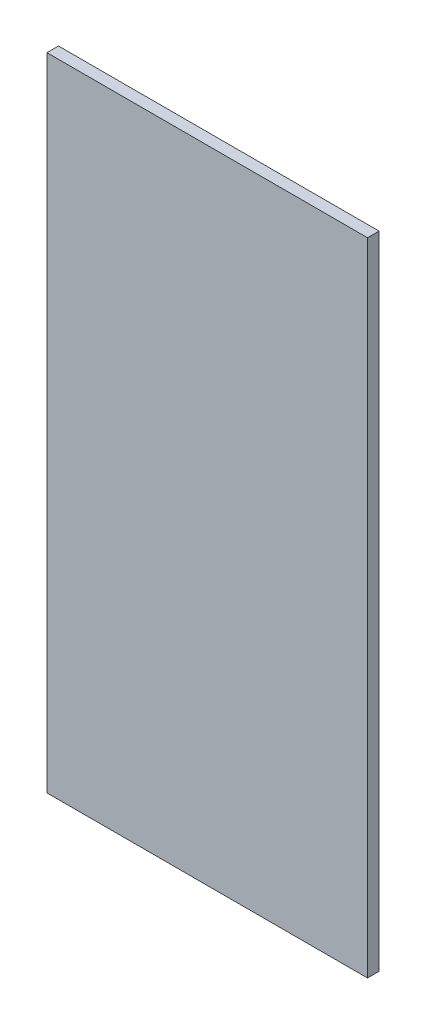
ISO-10303-21;
HEADER;
FILE_DESCRIPTION(('STEP AP214'),'2;1');
FILE_NAME('part.step','',(''),(''),'','','');
FILE_SCHEMA(('AUTOMOTIVE_DESIGN { 1 0 10303 214 1 1 1 1 }'));
ENDSEC;
DATA;
#1=APPLICATION_CONTEXT('core data for automotive mechanical design processes');
#2=APPLICATION_PROTOCOL_DEFINITION('international standard','automotive_design',2000,#1);
#3=PRODUCT_CONTEXT('',#1,'mechanical');
#4=PRODUCT('Part','Part','',(#3));
#5=PRODUCT_RELATED_PRODUCT_CATEGORY('part','',(#4));
#6=PRODUCT_DEFINITION_FORMATION('','',#4);
#7=PRODUCT_DEFINITION_CONTEXT('part definition',#1,'design');
#8=PRODUCT_DEFINITION('design','',#6,#7);
#9=PRODUCT_DEFINITION_SHAPE('','',#8);
#10=(LENGTH_UNIT() NAMED_UNIT(*) SI_UNIT(.MILLI.,.METRE.));
#11=(NAMED_UNIT(*) PLANE_ANGLE_UNIT() SI_UNIT($,.RADIAN.));
#12=(NAMED_UNIT(*) SI_UNIT($,.STERADIAN.) SOLID_ANGLE_UNIT());
#13=UNCERTAINTY_MEASURE_WITH_UNIT(LENGTH_MEASURE(1.E-05),#10,'distance_accuracy_value','');
#14=(GEOMETRIC_REPRESENTATION_CONTEXT(3) GLOBAL_UNCERTAINTY_ASSIGNED_CONTEXT((#13)) GLOBAL_UNIT_ASSIGNED_CONTEXT((#10,
#11,#12)) REPRESENTATION_CONTEXT('',''));
#15=CARTESIAN_POINT('',(0.,0.,0.));
#16=DIRECTION('',(0.,0.,1.));
#17=DIRECTION('',(1.,0.,0.));
#18=AXIS2_PLACEMENT_3D('',#15,#16,#17);
#19=CARTESIAN_POINT('',(1.625,0.5,-0.018));
#20=DIRECTION('',(0.,-1.,0.));
#21=DIRECTION('',(0.,0.,-1.));
#22=AXIS2_PLACEMENT_3D('',#19,#20,#21);
#23=PLANE('',#22);
#24=CARTESIAN_POINT('',(1.625,0.5,-0.018));
#25=CARTESIAN_POINT('',(2.125,0.5,-0.018));
#26=B_SPLINE_CURVE_WITH_KNOTS('',1,(#24,#25),.UNSPECIFIED.,.F.,.F.,(2,2),(-3.,-2.5),.UNSPECIFIED.);
#27=CARTESIAN_POINT('',(1.625,0.5,-0.018));
#28=VERTEX_POINT('',#27);
#29=CARTESIAN_POINT('',(2.125,0.5,-0.018));
#30=VERTEX_POINT('',#29);
#31=EDGE_CURVE('E11',#28,#30,#26,.T.);
#32=ORIENTED_EDGE('',*,*,#31,.T.);
#33=CARTESIAN_POINT('',(2.125,0.5,-0.018));
#34=CARTESIAN_POINT('',(2.125,0.5,0.));
#35=B_SPLINE_CURVE_WITH_KNOTS('',1,(#33,#34),.UNSPECIFIED.,.F.,.F.,(2,2),(0.,0.018),.UNSPECIFIED.);
#36=CARTESIAN_POINT('',(2.125,0.5,0.));
#37=VERTEX_POINT('',#36);
#38=EDGE_CURVE('E26',#30,#37,#35,.T.);
#39=ORIENTED_EDGE('',*,*,#38,.T.);
#40=CARTESIAN_POINT('',(1.625,0.5,0.));
#41=CARTESIAN_POINT('',(2.125,0.5,0.));
#42=B_SPLINE_CURVE_WITH_KNOTS('',1,(#40,#41),.UNSPECIFIED.,.F.,.F.,(2,2),(-3.,-2.5),.UNSPECIFIED.);
#43=CARTESIAN_POINT('',(1.625,0.5,0.));
#44=VERTEX_POINT('',#43);
#45=EDGE_CURVE('E132',#44,#37,#42,.T.);
#46=ORIENTED_EDGE('',*,*,#45,.F.);
#47=CARTESIAN_POINT('',(1.625,0.5,-0.018));
#48=CARTESIAN_POINT('',(1.625,0.5,0.));
#49=B_SPLINE_CURVE_WITH_KNOTS('',1,(#47,#48),.UNSPECIFIED.,.F.,.F.,(2,2),(0.,0.018),.UNSPECIFIED.);
#50=EDGE_CURVE('E79',#28,#44,#49,.T.);
#51=ORIENTED_EDGE('',*,*,#50,.F.);
#52=EDGE_LOOP('',(#32,#39,#46,#51));
#53=FACE_BOUND('',#52,.T.);
#54=ADVANCED_FACE('F17',(#53),#23,.T.);
#55=CARTESIAN_POINT('',(2.125,0.5,-0.018));
#56=DIRECTION('',(1.,0.,0.));
#57=DIRECTION('',(0.,0.,1.));
#58=AXIS2_PLACEMENT_3D('',#55,#56,#57);
#59=PLANE('',#58);
#60=CARTESIAN_POINT('',(2.125,0.5,-0.018));
#61=CARTESIAN_POINT('',(2.125,1.5,-0.018));
#62=B_SPLINE_CURVE_WITH_KNOTS('',1,(#60,#61),.UNSPECIFIED.,.F.,.F.,(2,2),(-2.5,-1.5),.UNSPECIFIED.);
#63=CARTESIAN_POINT('',(2.125,1.5,-0.018));
#64=VERTEX_POINT('',#63);
#65=EDGE_CURVE('E119',#30,#64,#62,.T.);
#66=ORIENTED_EDGE('',*,*,#65,.T.);
#67=CARTESIAN_POINT('',(2.125,1.5,-0.018));
#68=CARTESIAN_POINT('',(2.125,1.5,0.));
#69=B_SPLINE_CURVE_WITH_KNOTS('',1,(#67,#68),.UNSPECIFIED.,.F.,.F.,(2,2),(0.,0.018),.UNSPECIFIED.);
#70=CARTESIAN_POINT('',(2.125,1.5,0.));
#71=VERTEX_POINT('',#70);
#72=EDGE_CURVE('E112',#64,#71,#69,.T.);
#73=ORIENTED_EDGE('',*,*,#72,.T.);
#74=CARTESIAN_POINT('',(2.125,0.5,0.));
#75=CARTESIAN_POINT('',(2.125,1.5,0.));
#76=B_SPLINE_CURVE_WITH_KNOTS('',1,(#74,#75),.UNSPECIFIED.,.F.,.F.,(2,2),(-2.5,-1.5),.UNSPECIFIED.);
#77=EDGE_CURVE('E74',#37,#71,#76,.T.);
#78=ORIENTED_EDGE('',*,*,#77,.F.);
#79=ORIENTED_EDGE('',*,*,#38,.F.);
#80=EDGE_LOOP('',(#66,#73,#78,#79));
#81=FACE_BOUND('',#80,.T.);
#82=ADVANCED_FACE('F147',(#81),#59,.T.);
#83=CARTESIAN_POINT('',(2.125,1.5,-0.018));
#84=DIRECTION('',(0.,1.,0.));
#85=DIRECTION('',(0.,0.,1.));
#86=AXIS2_PLACEMENT_3D('',#83,#84,#85);
#87=PLANE('',#86);
#88=CARTESIAN_POINT('',(2.125,1.5,-0.018));
#89=CARTESIAN_POINT('',(1.625,1.5,-0.018));
#90=B_SPLINE_CURVE_WITH_KNOTS('',1,(#88,#89),.UNSPECIFIED.,.F.,.F.,(2,2),(-1.5,-1.),.UNSPECIFIED.);
#91=CARTESIAN_POINT('',(1.625,1.5,-0.018));
#92=VERTEX_POINT('',#91);
#93=EDGE_CURVE('E62',#64,#92,#90,.T.);
#94=ORIENTED_EDGE('',*,*,#93,.T.);
#95=CARTESIAN_POINT('',(1.625,1.5,-0.018));
#96=CARTESIAN_POINT('',(1.625,1.5,0.));
#97=B_SPLINE_CURVE_WITH_KNOTS('',1,(#95,#96),.UNSPECIFIED.,.F.,.F.,(2,2),(0.,0.018),.UNSPECIFIED.);
#98=CARTESIAN_POINT('',(1.625,1.5,0.));
#99=VERTEX_POINT('',#98);
#100=EDGE_CURVE('E56',#92,#99,#97,.T.);
#101=ORIENTED_EDGE('',*,*,#100,.T.);
#102=CARTESIAN_POINT('',(2.125,1.5,0.));
#103=CARTESIAN_POINT('',(1.625,1.5,0.));
#104=B_SPLINE_CURVE_WITH_KNOTS('',1,(#102,#103),.UNSPECIFIED.,.F.,.F.,(2,2),(-1.5,-1.),.UNSPECIFIED.);
#105=EDGE_CURVE('E60',#71,#99,#104,.T.);
#106=ORIENTED_EDGE('',*,*,#105,.F.);
#107=ORIENTED_EDGE('',*,*,#72,.F.);
#108=EDGE_LOOP('',(#94,#101,#106,#107));
#109=FACE_BOUND('',#108,.T.);
#110=ADVANCED_FACE('F58',(#109),#87,.T.);
#111=CARTESIAN_POINT('',(1.625,1.5,-0.018));
#112=DIRECTION('',(-1.,0.,0.));
#113=DIRECTION('',(0.,0.,-1.));
#114=AXIS2_PLACEMENT_3D('',#111,#112,#113);
#115=PLANE('',#114);
#116=CARTESIAN_POINT('',(1.625,1.5,-0.018));
#117=CARTESIAN_POINT('',(1.625,0.5,-0.018));
#118=B_SPLINE_CURVE_WITH_KNOTS('',1,(#116,#117),.UNSPECIFIED.,.F.,.F.,(2,2),(-1.,0.),.UNSPECIFIED.);
#119=EDGE_CURVE('E75',#92,#28,#118,.T.);
#120=ORIENTED_EDGE('',*,*,#119,.T.);
#121=ORIENTED_EDGE('',*,*,#50,.T.);
#122=CARTESIAN_POINT('',(1.625,1.5,0.));
#123=CARTESIAN_POINT('',(1.625,0.5,0.));
#124=B_SPLINE_CURVE_WITH_KNOTS('',1,(#122,#123),.UNSPECIFIED.,.F.,.F.,(2,2),(-1.,0.),.UNSPECIFIED.);
#125=EDGE_CURVE('E72',#99,#44,#124,.T.);
#126=ORIENTED_EDGE('',*,*,#125,.F.);
#127=ORIENTED_EDGE('',*,*,#100,.F.);
#128=EDGE_LOOP('',(#120,#121,#126,#127));
#129=FACE_BOUND('',#128,.T.);
#130=ADVANCED_FACE('F78',(#129),#115,.T.);
#131=CARTESIAN_POINT('',(2.125,1.5,-0.018));
#132=DIRECTION('',(0.,0.,-1.));
#133=DIRECTION('',(-1.,0.,0.));
#134=AXIS2_PLACEMENT_3D('',#131,#132,#133);
#135=PLANE('',#134);
#136=ORIENTED_EDGE('',*,*,#119,.F.);
#137=ORIENTED_EDGE('',*,*,#93,.F.);
#138=ORIENTED_EDGE('',*,*,#65,.F.);
#139=ORIENTED_EDGE('',*,*,#31,.F.);
#140=EDGE_LOOP('',(#136,#137,#138,#139));
#141=FACE_BOUND('',#140,.T.);
#142=ADVANCED_FACE('F148',(#141),#135,.T.);
#143=CARTESIAN_POINT('',(2.125,1.5,0.));
#144=DIRECTION('',(0.,0.,1.));
#145=DIRECTION('',(1.,0.,0.));
#146=AXIS2_PLACEMENT_3D('',#143,#144,#145);
#147=PLANE('',#146);
#148=ORIENTED_EDGE('',*,*,#45,.T.);
#149=ORIENTED_EDGE('',*,*,#77,.T.);
#150=ORIENTED_EDGE('',*,*,#105,.T.);
#151=ORIENTED_EDGE('',*,*,#125,.T.);
#152=EDGE_LOOP('',(#148,#149,#150,#151));
#153=FACE_BOUND('',#152,.T.);
#154=ADVANCED_FACE('F71',(#153),#147,.T.);
#155=CLOSED_SHELL('',(#54,#82,#110,#130,#142,#154));
#156=MANIFOLD_SOLID_BREP('B1',#155);
#157=ADVANCED_BREP_SHAPE_REPRESENTATION('',(#18,#156),#14);
#158=SHAPE_DEFINITION_REPRESENTATION(#9,#157);
ENDSEC;
END-ISO-10303-21;
